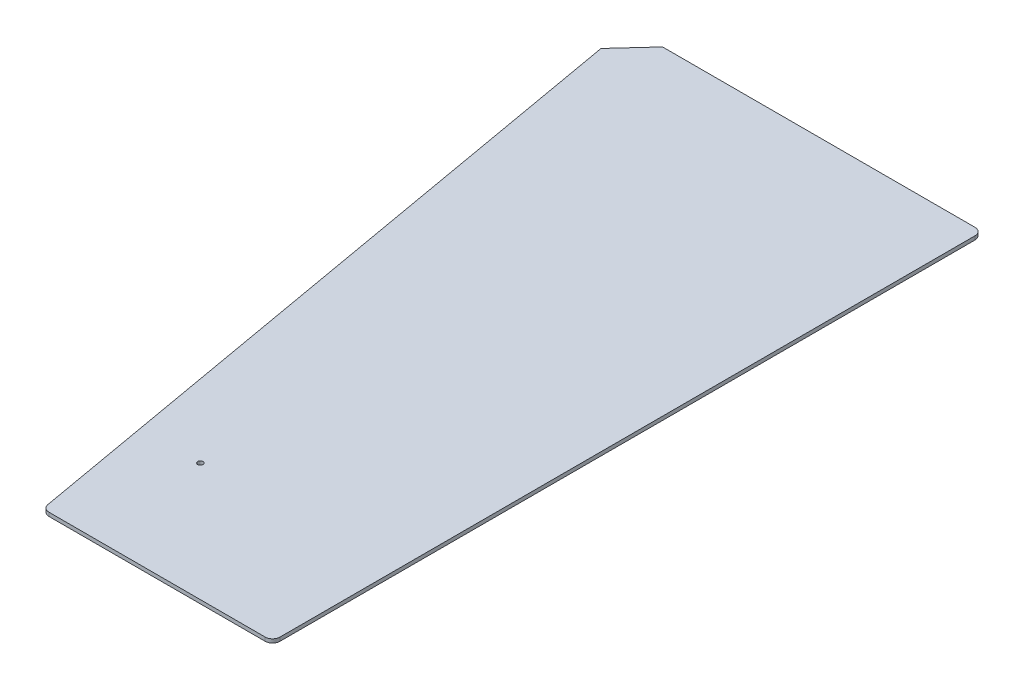
ISO-10303-21;
HEADER;
FILE_DESCRIPTION(('STEP AP214'),'2;1');
FILE_NAME('part.step','',(''),(''),'','','');
FILE_SCHEMA(('AUTOMOTIVE_DESIGN { 1 0 10303 214 1 1 1 1 }'));
ENDSEC;
DATA;
#1=APPLICATION_CONTEXT('core data for automotive mechanical design processes');
#2=APPLICATION_PROTOCOL_DEFINITION('international standard','automotive_design',2000,#1);
#3=PRODUCT_CONTEXT('',#1,'mechanical');
#4=PRODUCT('Part','Part','',(#3));
#5=PRODUCT_RELATED_PRODUCT_CATEGORY('part','',(#4));
#6=PRODUCT_DEFINITION_FORMATION('','',#4);
#7=PRODUCT_DEFINITION_CONTEXT('part definition',#1,'design');
#8=PRODUCT_DEFINITION('design','',#6,#7);
#9=PRODUCT_DEFINITION_SHAPE('','',#8);
#10=(LENGTH_UNIT() NAMED_UNIT(*) SI_UNIT(.MILLI.,.METRE.));
#11=(NAMED_UNIT(*) PLANE_ANGLE_UNIT() SI_UNIT($,.RADIAN.));
#12=(NAMED_UNIT(*) SI_UNIT($,.STERADIAN.) SOLID_ANGLE_UNIT());
#13=UNCERTAINTY_MEASURE_WITH_UNIT(LENGTH_MEASURE(1.E-05),#10,'distance_accuracy_value','');
#14=(GEOMETRIC_REPRESENTATION_CONTEXT(3) GLOBAL_UNCERTAINTY_ASSIGNED_CONTEXT((#13)) GLOBAL_UNIT_ASSIGNED_CONTEXT((#10,
#11,#12)) REPRESENTATION_CONTEXT('',''));
#15=CARTESIAN_POINT('',(0.,0.,0.));
#16=DIRECTION('',(0.,0.,1.));
#17=DIRECTION('',(1.,0.,0.));
#18=AXIS2_PLACEMENT_3D('',#15,#16,#17);
#19=CARTESIAN_POINT('',(-72.2076680158914,3.175,233.2002437725));
#20=DIRECTION('',(0.,-1.,0.));
#21=DIRECTION('',(0.,0.,-1.));
#22=AXIS2_PLACEMENT_3D('',#19,#20,#21);
#23=CYLINDRICAL_SURFACE('',#22,6.35000000000003);
#24=CARTESIAN_POINT('',(-72.2076680158914,0.,233.2002437725));
#25=DIRECTION('',(0.,1.,0.));
#26=DIRECTION('',(0.,0.,-1.));
#27=AXIS2_PLACEMENT_3D('',#24,#25,#26);
#28=CIRCLE('',#27,6.35000000000003);
#29=CARTESIAN_POINT('',(-78.4611972475189,0.,234.302909700685));
#30=VERTEX_POINT('',#29);
#31=CARTESIAN_POINT('',(-72.2076680158914,0.,239.5502437725));
#32=VERTEX_POINT('',#31);
#33=EDGE_CURVE('E135',#30,#32,#28,.T.);
#34=ORIENTED_EDGE('',*,*,#33,.T.);
#35=DIRECTION('',(0.,-1.,0.));
#36=VECTOR('',#35,1.);
#37=CARTESIAN_POINT('',(-72.2076680158914,3.175,239.5502437725));
#38=LINE('',#37,#36);
#39=CARTESIAN_POINT('',(-72.2076680158914,3.175,239.5502437725));
#40=VERTEX_POINT('',#39);
#41=EDGE_CURVE('E11',#40,#32,#38,.T.);
#42=ORIENTED_EDGE('',*,*,#41,.F.);
#43=CARTESIAN_POINT('',(-72.2076680158914,3.175,233.2002437725));
#44=DIRECTION('',(0.,1.,0.));
#45=DIRECTION('',(0.,0.,-1.));
#46=AXIS2_PLACEMENT_3D('',#43,#44,#45);
#47=CIRCLE('',#46,6.35000000000003);
#48=CARTESIAN_POINT('',(-78.4611972475189,3.175,234.302909700685));
#49=VERTEX_POINT('',#48);
#50=EDGE_CURVE('E147',#49,#40,#47,.T.);
#51=ORIENTED_EDGE('',*,*,#50,.F.);
#52=DIRECTION('',(0.,-1.,0.));
#53=VECTOR('',#52,1.);
#54=CARTESIAN_POINT('',(-78.4611972475189,3.175,234.302909700685));
#55=LINE('',#54,#53);
#56=EDGE_CURVE('E131',#49,#30,#55,.T.);
#57=ORIENTED_EDGE('',*,*,#56,.T.);
#58=EDGE_LOOP('',(#34,#42,#51,#57));
#59=FACE_BOUND('',#58,.T.);
#60=ADVANCED_FACE('F39',(#59),#23,.T.);
#61=CARTESIAN_POINT('',(-72.2076680158914,3.175,239.5502437725));
#62=DIRECTION('',(0.,0.,-1.));
#63=DIRECTION('',(-1.,0.,0.));
#64=AXIS2_PLACEMENT_3D('',#61,#62,#63);
#65=PLANE('',#64);
#66=DIRECTION('',(1.,0.,0.));
#67=VECTOR('',#66,1.);
#68=CARTESIAN_POINT('',(-72.2076680158914,0.,239.5502437725));
#69=LINE('',#68,#67);
#70=CARTESIAN_POINT('',(113.42512188625,0.,239.5502437725));
#71=VERTEX_POINT('',#70);
#72=EDGE_CURVE('E138',#32,#71,#69,.T.);
#73=ORIENTED_EDGE('',*,*,#72,.T.);
#74=DIRECTION('',(0.,-1.,0.));
#75=VECTOR('',#74,1.);
#76=CARTESIAN_POINT('',(113.42512188625,3.175,239.5502437725));
#77=LINE('',#76,#75);
#78=CARTESIAN_POINT('',(113.42512188625,3.175,239.5502437725));
#79=VERTEX_POINT('',#78);
#80=EDGE_CURVE('E50',#79,#71,#77,.T.);
#81=ORIENTED_EDGE('',*,*,#80,.F.);
#82=DIRECTION('',(1.,0.,0.));
#83=VECTOR('',#82,1.);
#84=CARTESIAN_POINT('',(-72.2076680158914,3.175,239.5502437725));
#85=LINE('',#84,#83);
#86=EDGE_CURVE('E98',#40,#79,#85,.T.);
#87=ORIENTED_EDGE('',*,*,#86,.F.);
#88=ORIENTED_EDGE('',*,*,#41,.T.);
#89=EDGE_LOOP('',(#73,#81,#87,#88));
#90=FACE_BOUND('',#89,.T.);
#91=ADVANCED_FACE('F206',(#90),#65,.F.);
#92=CARTESIAN_POINT('',(113.42512188625,3.175,233.2002437725));
#93=DIRECTION('',(0.,-1.,0.));
#94=DIRECTION('',(0.,0.,-1.));
#95=AXIS2_PLACEMENT_3D('',#92,#93,#94);
#96=CYLINDRICAL_SURFACE('',#95,6.35000000000001);
#97=CARTESIAN_POINT('',(113.42512188625,0.,233.2002437725));
#98=DIRECTION('',(0.,1.,0.));
#99=DIRECTION('',(0.,0.,-1.));
#100=AXIS2_PLACEMENT_3D('',#97,#98,#99);
#101=CIRCLE('',#100,6.35000000000001);
#102=CARTESIAN_POINT('',(119.77512188625,0.,233.2002437725));
#103=VERTEX_POINT('',#102);
#104=EDGE_CURVE('E143',#71,#103,#101,.T.);
#105=ORIENTED_EDGE('',*,*,#104,.T.);
#106=DIRECTION('',(0.,-1.,0.));
#107=VECTOR('',#106,1.);
#108=CARTESIAN_POINT('',(119.77512188625,3.175,233.2002437725));
#109=LINE('',#108,#107);
#110=CARTESIAN_POINT('',(119.77512188625,3.175,233.2002437725));
#111=VERTEX_POINT('',#110);
#112=EDGE_CURVE('E160',#111,#103,#109,.T.);
#113=ORIENTED_EDGE('',*,*,#112,.F.);
#114=CARTESIAN_POINT('',(113.42512188625,3.175,233.2002437725));
#115=DIRECTION('',(0.,1.,0.));
#116=DIRECTION('',(0.,0.,-1.));
#117=AXIS2_PLACEMENT_3D('',#114,#115,#116);
#118=CIRCLE('',#117,6.35000000000001);
#119=EDGE_CURVE('E164',#79,#111,#118,.T.);
#120=ORIENTED_EDGE('',*,*,#119,.F.);
#121=ORIENTED_EDGE('',*,*,#80,.T.);
#122=EDGE_LOOP('',(#105,#113,#120,#121));
#123=FACE_BOUND('',#122,.T.);
#124=ADVANCED_FACE('F162',(#123),#96,.T.);
#125=CARTESIAN_POINT('',(119.77512188625,3.175,233.2002437725));
#126=DIRECTION('',(-1.,0.,0.));
#127=DIRECTION('',(0.,0.,1.));
#128=AXIS2_PLACEMENT_3D('',#125,#126,#127);
#129=PLANE('',#128);
#130=DIRECTION('',(0.,0.,-1.));
#131=VECTOR('',#130,1.);
#132=CARTESIAN_POINT('',(119.77512188625,0.,233.2002437725));
#133=LINE('',#132,#131);
#134=CARTESIAN_POINT('',(119.77512188625,0.,-363.6997562275));
#135=VERTEX_POINT('',#134);
#136=EDGE_CURVE('E141',#103,#135,#133,.T.);
#137=ORIENTED_EDGE('',*,*,#136,.T.);
#138=DIRECTION('',(0.,-1.,0.));
#139=VECTOR('',#138,1.);
#140=CARTESIAN_POINT('',(119.77512188625,3.175,-363.6997562275));
#141=LINE('',#140,#139);
#142=CARTESIAN_POINT('',(119.77512188625,3.175,-363.6997562275));
#143=VERTEX_POINT('',#142);
#144=EDGE_CURVE('E152',#143,#135,#141,.T.);
#145=ORIENTED_EDGE('',*,*,#144,.F.);
#146=DIRECTION('',(0.,0.,-1.));
#147=VECTOR('',#146,1.);
#148=CARTESIAN_POINT('',(119.77512188625,3.175,233.2002437725));
#149=LINE('',#148,#147);
#150=EDGE_CURVE('E180',#111,#143,#149,.T.);
#151=ORIENTED_EDGE('',*,*,#150,.F.);
#152=ORIENTED_EDGE('',*,*,#112,.T.);
#153=EDGE_LOOP('',(#137,#145,#151,#152));
#154=FACE_BOUND('',#153,.T.);
#155=ADVANCED_FACE('F174',(#154),#129,.F.);
#156=CARTESIAN_POINT('',(113.42512188625,3.175,-363.6997562275));
#157=DIRECTION('',(0.,-1.,0.));
#158=DIRECTION('',(0.,0.,-1.));
#159=AXIS2_PLACEMENT_3D('',#156,#157,#158);
#160=CYLINDRICAL_SURFACE('',#159,6.35000000000002);
#161=CARTESIAN_POINT('',(113.42512188625,0.,-363.6997562275));
#162=DIRECTION('',(0.,1.,0.));
#163=DIRECTION('',(0.,0.,1.));
#164=AXIS2_PLACEMENT_3D('',#161,#162,#163);
#165=CIRCLE('',#164,6.35000000000002);
#166=CARTESIAN_POINT('',(113.42512188625,0.,-370.0497562275));
#167=VERTEX_POINT('',#166);
#168=EDGE_CURVE('E144',#135,#167,#165,.T.);
#169=ORIENTED_EDGE('',*,*,#168,.T.);
#170=DIRECTION('',(0.,-1.,0.));
#171=VECTOR('',#170,1.);
#172=CARTESIAN_POINT('',(113.42512188625,3.175,-370.0497562275));
#173=LINE('',#172,#171);
#174=CARTESIAN_POINT('',(113.42512188625,3.175,-370.0497562275));
#175=VERTEX_POINT('',#174);
#176=EDGE_CURVE('E127',#175,#167,#173,.T.);
#177=ORIENTED_EDGE('',*,*,#176,.F.);
#178=CARTESIAN_POINT('',(113.42512188625,3.175,-363.6997562275));
#179=DIRECTION('',(0.,1.,0.));
#180=DIRECTION('',(0.,0.,1.));
#181=AXIS2_PLACEMENT_3D('',#178,#179,#180);
#182=CIRCLE('',#181,6.35000000000002);
#183=EDGE_CURVE('E117',#143,#175,#182,.T.);
#184=ORIENTED_EDGE('',*,*,#183,.F.);
#185=ORIENTED_EDGE('',*,*,#144,.T.);
#186=EDGE_LOOP('',(#169,#177,#184,#185));
#187=FACE_BOUND('',#186,.T.);
#188=ADVANCED_FACE('F176',(#187),#160,.T.);
#189=CARTESIAN_POINT('',(-154.880183722142,3.175,-370.0497562275));
#190=DIRECTION('',(0.,0.,1.));
#191=DIRECTION('',(1.,0.,0.));
#192=AXIS2_PLACEMENT_3D('',#189,#190,#191);
#193=PLANE('',#192);
#194=DIRECTION('',(-1.,0.,0.));
#195=VECTOR('',#194,1.);
#196=CARTESIAN_POINT('',(-154.880183722142,0.,-370.0497562275));
#197=LINE('',#196,#195);
#198=CARTESIAN_POINT('',(-154.880183722142,0.,-370.0497562275));
#199=VERTEX_POINT('',#198);
#200=EDGE_CURVE('E124',#167,#199,#197,.T.);
#201=ORIENTED_EDGE('',*,*,#200,.T.);
#202=DIRECTION('',(0.,-1.,0.));
#203=VECTOR('',#202,1.);
#204=CARTESIAN_POINT('',(-154.880183722142,3.175,-370.0497562275));
#205=LINE('',#204,#203);
#206=CARTESIAN_POINT('',(-154.880183722142,3.175,-370.0497562275));
#207=VERTEX_POINT('',#206);
#208=EDGE_CURVE('E125',#207,#199,#205,.T.);
#209=ORIENTED_EDGE('',*,*,#208,.F.);
#210=DIRECTION('',(-1.,0.,0.));
#211=VECTOR('',#210,1.);
#212=CARTESIAN_POINT('',(-154.880183722142,3.175,-370.0497562275));
#213=LINE('',#212,#211);
#214=EDGE_CURVE('E112',#175,#207,#213,.T.);
#215=ORIENTED_EDGE('',*,*,#214,.F.);
#216=ORIENTED_EDGE('',*,*,#176,.T.);
#217=EDGE_LOOP('',(#201,#209,#215,#216));
#218=FACE_BOUND('',#217,.T.);
#219=ADVANCED_FACE('F123',(#218),#193,.F.);
#220=CARTESIAN_POINT('',(-154.880183722142,3.175,-370.0497562275));
#221=DIRECTION('',(0.73727733681013,0.,0.675590207615654));
#222=DIRECTION('',(0.675590207615654,0.,-0.73727733681013));
#223=AXIS2_PLACEMENT_3D('',#220,#221,#222);
#224=PLANE('',#223);
#225=DIRECTION('',(-0.675590207615654,0.,0.73727733681013));
#226=VECTOR('',#225,1.);
#227=CARTESIAN_POINT('',(-154.880183722142,0.,-370.0497562275));
#228=LINE('',#227,#226);
#229=CARTESIAN_POINT('',(-180.160298168538,0.,-342.461352424144));
#230=VERTEX_POINT('',#229);
#231=EDGE_CURVE('E82',#199,#230,#228,.T.);
#232=ORIENTED_EDGE('',*,*,#231,.T.);
#233=DIRECTION('',(0.,-1.,0.));
#234=VECTOR('',#233,1.);
#235=CARTESIAN_POINT('',(-180.160298168538,3.175,-342.461352424144));
#236=LINE('',#235,#234);
#237=CARTESIAN_POINT('',(-180.160298168538,3.175,-342.461352424144));
#238=VERTEX_POINT('',#237);
#239=EDGE_CURVE('E130',#238,#230,#236,.T.);
#240=ORIENTED_EDGE('',*,*,#239,.F.);
#241=DIRECTION('',(-0.675590207615654,0.,0.73727733681013));
#242=VECTOR('',#241,1.);
#243=CARTESIAN_POINT('',(-154.880183722142,3.175,-370.0497562275));
#244=LINE('',#243,#242);
#245=EDGE_CURVE('E113',#207,#238,#244,.T.);
#246=ORIENTED_EDGE('',*,*,#245,.F.);
#247=ORIENTED_EDGE('',*,*,#208,.T.);
#248=EDGE_LOOP('',(#232,#240,#246,#247));
#249=FACE_BOUND('',#248,.T.);
#250=ADVANCED_FACE('F129',(#249),#224,.F.);
#251=CARTESIAN_POINT('',(-78.4611972475189,3.175,234.302909700685));
#252=DIRECTION('',(0.984807753012207,0.,-0.173648177666935));
#253=DIRECTION('',(-0.173648177666935,0.,-0.984807753012207));
#254=AXIS2_PLACEMENT_3D('',#251,#252,#253);
#255=PLANE('',#254);
#256=DIRECTION('',(0.173648177666935,0.,0.984807753012207));
#257=VECTOR('',#256,1.);
#258=CARTESIAN_POINT('',(-78.4611972475189,0.,234.302909700685));
#259=LINE('',#258,#257);
#260=EDGE_CURVE('E89',#230,#30,#259,.T.);
#261=ORIENTED_EDGE('',*,*,#260,.T.);
#262=ORIENTED_EDGE('',*,*,#56,.F.);
#263=DIRECTION('',(0.173648177666935,0.,0.984807753012207));
#264=VECTOR('',#263,1.);
#265=CARTESIAN_POINT('',(-78.4611972475189,3.175,234.302909700685));
#266=LINE('',#265,#264);
#267=EDGE_CURVE('E54',#238,#49,#266,.T.);
#268=ORIENTED_EDGE('',*,*,#267,.F.);
#269=ORIENTED_EDGE('',*,*,#239,.T.);
#270=EDGE_LOOP('',(#261,#262,#268,#269));
#271=FACE_BOUND('',#270,.T.);
#272=ADVANCED_FACE('F197',(#271),#255,.F.);
#273=CARTESIAN_POINT('',(-72.2076680158914,3.175,233.2002437725));
#274=DIRECTION('',(0.,-1.,0.));
#275=DIRECTION('',(0.,0.,-1.));
#276=AXIS2_PLACEMENT_3D('',#273,#274,#275);
#277=PLANE('',#276);
#278=CARTESIAN_POINT('',(-43.8671000300517,3.175,137.9502437725));
#279=DIRECTION('',(0.,1.,0.));
#280=DIRECTION('',(0.,0.,1.));
#281=AXIS2_PLACEMENT_3D('',#278,#279,#280);
#282=CIRCLE('',#281,2.28599999999996);
#283=CARTESIAN_POINT('',(-43.8671000300517,3.175,140.2362437725));
#284=VERTEX_POINT('',#283);
#285=EDGE_CURVE('E181',#284,#284,#282,.T.);
#286=ORIENTED_EDGE('',*,*,#285,.F.);
#287=EDGE_LOOP('',(#286));
#288=FACE_BOUND('',#287,.T.);
#289=ORIENTED_EDGE('',*,*,#50,.T.);
#290=ORIENTED_EDGE('',*,*,#86,.T.);
#291=ORIENTED_EDGE('',*,*,#119,.T.);
#292=ORIENTED_EDGE('',*,*,#150,.T.);
#293=ORIENTED_EDGE('',*,*,#183,.T.);
#294=ORIENTED_EDGE('',*,*,#214,.T.);
#295=ORIENTED_EDGE('',*,*,#245,.T.);
#296=ORIENTED_EDGE('',*,*,#267,.T.);
#297=EDGE_LOOP('',(#289,#290,#291,#292,#293,#294,#295,#296));
#298=FACE_BOUND('',#297,.T.);
#299=ADVANCED_FACE('F114',(#288,#298),#277,.F.);
#300=CARTESIAN_POINT('',(-72.2076680158914,0.,233.2002437725));
#301=DIRECTION('',(0.,-1.,0.));
#302=DIRECTION('',(0.,0.,-1.));
#303=AXIS2_PLACEMENT_3D('',#300,#301,#302);
#304=PLANE('',#303);
#305=CARTESIAN_POINT('',(-43.8671000300517,0.,137.9502437725));
#306=DIRECTION('',(0.,1.,0.));
#307=DIRECTION('',(0.,0.,1.));
#308=AXIS2_PLACEMENT_3D('',#305,#306,#307);
#309=CIRCLE('',#308,2.28599999999996);
#310=CARTESIAN_POINT('',(-43.8671000300517,0.,140.2362437725));
#311=VERTEX_POINT('',#310);
#312=EDGE_CURVE('E137',#311,#311,#309,.T.);
#313=ORIENTED_EDGE('',*,*,#312,.T.);
#314=EDGE_LOOP('',(#313));
#315=FACE_BOUND('',#314,.T.);
#316=ORIENTED_EDGE('',*,*,#33,.F.);
#317=ORIENTED_EDGE('',*,*,#260,.F.);
#318=ORIENTED_EDGE('',*,*,#231,.F.);
#319=ORIENTED_EDGE('',*,*,#200,.F.);
#320=ORIENTED_EDGE('',*,*,#168,.F.);
#321=ORIENTED_EDGE('',*,*,#136,.F.);
#322=ORIENTED_EDGE('',*,*,#104,.F.);
#323=ORIENTED_EDGE('',*,*,#72,.F.);
#324=EDGE_LOOP('',(#316,#317,#318,#319,#320,#321,#322,#323));
#325=FACE_BOUND('',#324,.T.);
#326=ADVANCED_FACE('F166',(#315,#325),#304,.T.);
#327=CARTESIAN_POINT('',(-43.8671000300517,0.,137.9502437725));
#328=DIRECTION('',(0.,1.,0.));
#329=DIRECTION('',(0.,0.,1.));
#330=AXIS2_PLACEMENT_3D('',#327,#328,#329);
#331=CYLINDRICAL_SURFACE('',#330,2.28599999999996);
#332=ORIENTED_EDGE('',*,*,#312,.F.);
#333=EDGE_LOOP('',(#332));
#334=FACE_BOUND('',#333,.T.);
#335=ORIENTED_EDGE('',*,*,#285,.T.);
#336=EDGE_LOOP('',(#335));
#337=FACE_BOUND('',#336,.T.);
#338=ADVANCED_FACE('F190',(#334,#337),#331,.F.);
#339=CLOSED_SHELL('',(#60,#91,#124,#155,#188,#219,#250,#272,#299,#326,#338));
#340=MANIFOLD_SOLID_BREP('B2',#339);
#341=ADVANCED_BREP_SHAPE_REPRESENTATION('',(#18,#340),#14);
#342=SHAPE_DEFINITION_REPRESENTATION(#9,#341);
ENDSEC;
END-ISO-10303-21;
